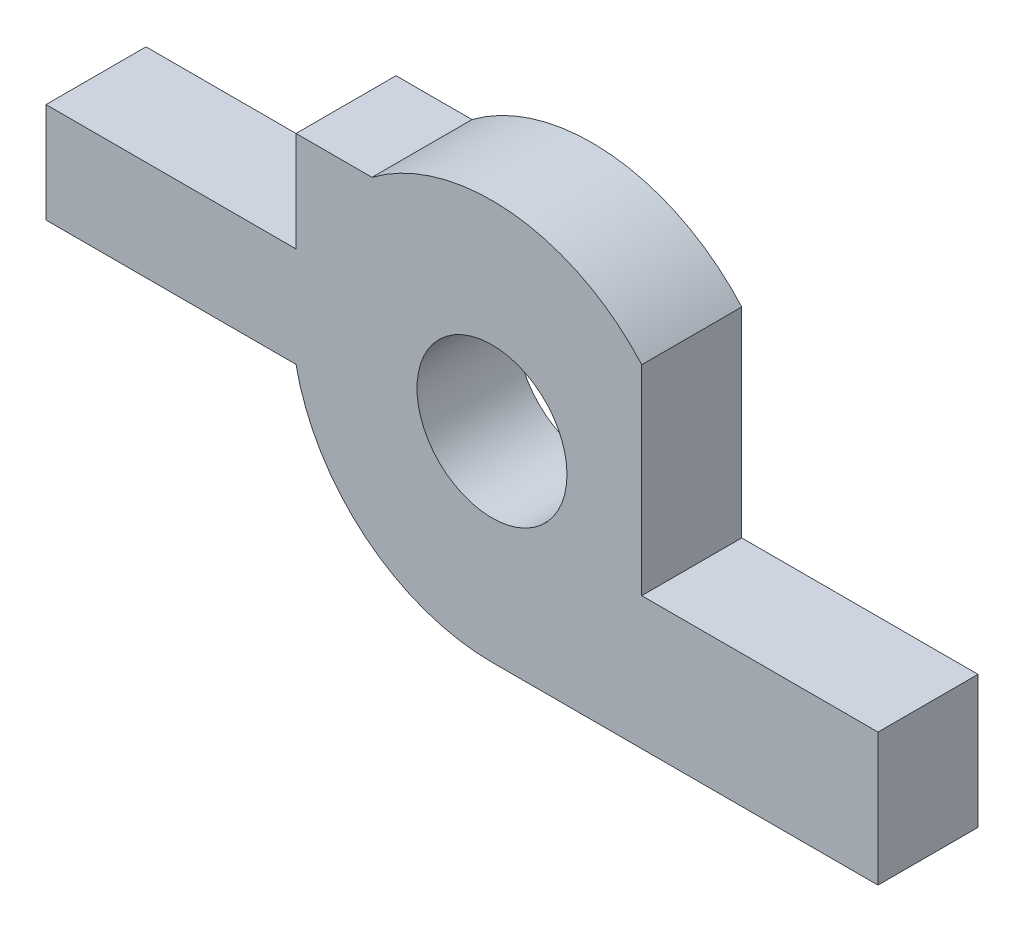
ISO-10303-21;
HEADER;
FILE_DESCRIPTION(('STEP AP214'),'2;1');
FILE_NAME('part.step','',(''),(''),'','','');
FILE_SCHEMA(('AUTOMOTIVE_DESIGN { 1 0 10303 214 1 1 1 1 }'));
ENDSEC;
DATA;
#1=APPLICATION_CONTEXT('core data for automotive mechanical design processes');
#2=APPLICATION_PROTOCOL_DEFINITION('international standard','automotive_design',2000,#1);
#3=PRODUCT_CONTEXT('',#1,'mechanical');
#4=PRODUCT('Part','Part','',(#3));
#5=PRODUCT_RELATED_PRODUCT_CATEGORY('part','',(#4));
#6=PRODUCT_DEFINITION_FORMATION('','',#4);
#7=PRODUCT_DEFINITION_CONTEXT('part definition',#1,'design');
#8=PRODUCT_DEFINITION('design','',#6,#7);
#9=PRODUCT_DEFINITION_SHAPE('','',#8);
#10=(LENGTH_UNIT() NAMED_UNIT(*) SI_UNIT(.MILLI.,.METRE.));
#11=(NAMED_UNIT(*) PLANE_ANGLE_UNIT() SI_UNIT($,.RADIAN.));
#12=(NAMED_UNIT(*) SI_UNIT($,.STERADIAN.) SOLID_ANGLE_UNIT());
#13=UNCERTAINTY_MEASURE_WITH_UNIT(LENGTH_MEASURE(1.E-05),#10,'distance_accuracy_value','');
#14=(GEOMETRIC_REPRESENTATION_CONTEXT(3) GLOBAL_UNCERTAINTY_ASSIGNED_CONTEXT((#13)) GLOBAL_UNIT_ASSIGNED_CONTEXT((#10,
#11,#12)) REPRESENTATION_CONTEXT('',''));
#15=CARTESIAN_POINT('',(0.,0.,0.));
#16=DIRECTION('',(0.,0.,1.));
#17=DIRECTION('',(1.,0.,0.));
#18=AXIS2_PLACEMENT_3D('',#15,#16,#17);
#19=CARTESIAN_POINT('',(0.,0.,2.));
#20=DIRECTION('',(0.,0.,1.));
#21=DIRECTION('',(1.,0.,0.));
#22=AXIS2_PLACEMENT_3D('',#19,#20,#21);
#23=PLANE('',#22);
#24=CARTESIAN_POINT('',(0.,0.,2.));
#25=DIRECTION('',(0.,0.,1.));
#26=DIRECTION('',(1.,0.,0.));
#27=AXIS2_PLACEMENT_3D('',#24,#25,#26);
#28=CIRCLE('',#27,4.);
#29=CARTESIAN_POINT('',(-3.91918358845309,-0.8,2.));
#30=VERTEX_POINT('',#29);
#31=CARTESIAN_POINT('',(0.,-4.,2.));
#32=VERTEX_POINT('',#31);
#33=EDGE_CURVE('E168',#30,#32,#28,.T.);
#34=ORIENTED_EDGE('',*,*,#33,.T.);
#35=DIRECTION('',(1.,0.,0.));
#36=VECTOR('',#35,1.);
#37=CARTESIAN_POINT('',(7.72000000000002,-4.,2.));
#38=LINE('',#37,#36);
#39=CARTESIAN_POINT('',(7.72000000000002,-4.,2.));
#40=VERTEX_POINT('',#39);
#41=EDGE_CURVE('E101',#32,#40,#38,.T.);
#42=ORIENTED_EDGE('',*,*,#41,.T.);
#43=DIRECTION('',(0.,1.,0.));
#44=VECTOR('',#43,1.);
#45=CARTESIAN_POINT('',(7.72,-1.34852681521862,2.));
#46=LINE('',#45,#44);
#47=CARTESIAN_POINT('',(7.72,-1.34852681521862,2.));
#48=VERTEX_POINT('',#47);
#49=EDGE_CURVE('E192',#40,#48,#46,.T.);
#50=ORIENTED_EDGE('',*,*,#49,.T.);
#51=DIRECTION('',(-1.,0.,0.));
#52=VECTOR('',#51,1.);
#53=CARTESIAN_POINT('',(2.99494406465051,-1.34852681521862,2.));
#54=LINE('',#53,#52);
#55=CARTESIAN_POINT('',(2.99494406465051,-1.34852681521862,2.));
#56=VERTEX_POINT('',#55);
#57=EDGE_CURVE('E211',#48,#56,#54,.T.);
#58=ORIENTED_EDGE('',*,*,#57,.T.);
#59=DIRECTION('',(0.,1.,0.));
#60=VECTOR('',#59,1.);
#61=CARTESIAN_POINT('',(2.99494406465051,2.65147318478138,2.));
#62=LINE('',#61,#60);
#63=CARTESIAN_POINT('',(2.99494406465051,2.65147318478138,2.));
#64=VERTEX_POINT('',#63);
#65=EDGE_CURVE('E208',#56,#64,#62,.T.);
#66=ORIENTED_EDGE('',*,*,#65,.T.);
#67=CARTESIAN_POINT('',(0.,0.,2.));
#68=DIRECTION('',(0.,0.,1.));
#69=DIRECTION('',(1.,0.,0.));
#70=AXIS2_PLACEMENT_3D('',#67,#68,#69);
#71=CIRCLE('',#70,4.);
#72=CARTESIAN_POINT('',(-2.40000000000001,3.2,2.));
#73=VERTEX_POINT('',#72);
#74=EDGE_CURVE('E210',#64,#73,#71,.T.);
#75=ORIENTED_EDGE('',*,*,#74,.T.);
#76=DIRECTION('',(-1.,0.,0.));
#77=VECTOR('',#76,1.);
#78=CARTESIAN_POINT('',(-3.91918358845309,3.2,2.));
#79=LINE('',#78,#77);
#80=CARTESIAN_POINT('',(-3.91918358845309,3.2,2.));
#81=VERTEX_POINT('',#80);
#82=EDGE_CURVE('E213',#73,#81,#79,.T.);
#83=ORIENTED_EDGE('',*,*,#82,.T.);
#84=DIRECTION('',(0.,-1.,0.));
#85=VECTOR('',#84,1.);
#86=CARTESIAN_POINT('',(-3.91918358845309,1.2,2.));
#87=LINE('',#86,#85);
#88=CARTESIAN_POINT('',(-3.91918358845309,1.2,2.));
#89=VERTEX_POINT('',#88);
#90=EDGE_CURVE('E129',#81,#89,#87,.T.);
#91=ORIENTED_EDGE('',*,*,#90,.T.);
#92=DIRECTION('',(-1.,0.,0.));
#93=VECTOR('',#92,1.);
#94=CARTESIAN_POINT('',(-3.91918358845309,1.2,2.));
#95=LINE('',#94,#93);
#96=CARTESIAN_POINT('',(-8.91918358845309,1.2,2.));
#97=VERTEX_POINT('',#96);
#98=EDGE_CURVE('E123',#89,#97,#95,.T.);
#99=ORIENTED_EDGE('',*,*,#98,.T.);
#100=DIRECTION('',(0.,-1.,0.));
#101=VECTOR('',#100,1.);
#102=CARTESIAN_POINT('',(-8.91918358845309,1.2,2.));
#103=LINE('',#102,#101);
#104=CARTESIAN_POINT('',(-8.91918358845305,-0.799999999999993,2.));
#105=VERTEX_POINT('',#104);
#106=EDGE_CURVE('E127',#97,#105,#103,.T.);
#107=ORIENTED_EDGE('',*,*,#106,.T.);
#108=DIRECTION('',(1.,0.,0.));
#109=VECTOR('',#108,1.);
#110=CARTESIAN_POINT('',(-3.91918358845309,-0.8,2.));
#111=LINE('',#110,#109);
#112=EDGE_CURVE('E49',#105,#30,#111,.T.);
#113=ORIENTED_EDGE('',*,*,#112,.T.);
#114=EDGE_LOOP('',(#34,#42,#50,#58,#66,#75,#83,#91,#99,#107,#113));
#115=FACE_BOUND('',#114,.T.);
#116=CARTESIAN_POINT('',(0.,0.,2.));
#117=DIRECTION('',(0.,0.,1.));
#118=DIRECTION('',(1.,0.,0.));
#119=AXIS2_PLACEMENT_3D('',#116,#117,#118);
#120=CIRCLE('',#119,1.5);
#121=CARTESIAN_POINT('',(1.5,0.,2.));
#122=VERTEX_POINT('',#121);
#123=EDGE_CURVE('E151',#122,#122,#120,.T.);
#124=ORIENTED_EDGE('',*,*,#123,.F.);
#125=EDGE_LOOP('',(#124));
#126=FACE_BOUND('',#125,.T.);
#127=ADVANCED_FACE('F32',(#115,#126),#23,.T.);
#128=CARTESIAN_POINT('',(0.,0.,0.));
#129=DIRECTION('',(0.,0.,1.));
#130=DIRECTION('',(1.,0.,0.));
#131=AXIS2_PLACEMENT_3D('',#128,#129,#130);
#132=PLANE('',#131);
#133=CARTESIAN_POINT('',(0.,0.,0.));
#134=DIRECTION('',(0.,0.,1.));
#135=DIRECTION('',(1.,0.,0.));
#136=AXIS2_PLACEMENT_3D('',#133,#134,#135);
#137=CIRCLE('',#136,4.);
#138=CARTESIAN_POINT('',(-3.91918358845309,-0.8,0.));
#139=VERTEX_POINT('',#138);
#140=CARTESIAN_POINT('',(0.,-4.,0.));
#141=VERTEX_POINT('',#140);
#142=EDGE_CURVE('E147',#139,#141,#137,.T.);
#143=ORIENTED_EDGE('',*,*,#142,.F.);
#144=DIRECTION('',(1.,0.,0.));
#145=VECTOR('',#144,1.);
#146=CARTESIAN_POINT('',(-3.91918358845309,-0.8,0.));
#147=LINE('',#146,#145);
#148=CARTESIAN_POINT('',(-8.91918358845305,-0.799999999999993,0.));
#149=VERTEX_POINT('',#148);
#150=EDGE_CURVE('E93',#149,#139,#147,.T.);
#151=ORIENTED_EDGE('',*,*,#150,.F.);
#152=DIRECTION('',(0.,-1.,0.));
#153=VECTOR('',#152,1.);
#154=CARTESIAN_POINT('',(-8.91918358845309,1.2,0.));
#155=LINE('',#154,#153);
#156=CARTESIAN_POINT('',(-8.91918358845309,1.2,0.));
#157=VERTEX_POINT('',#156);
#158=EDGE_CURVE('E87',#157,#149,#155,.T.);
#159=ORIENTED_EDGE('',*,*,#158,.F.);
#160=DIRECTION('',(-1.,0.,0.));
#161=VECTOR('',#160,1.);
#162=CARTESIAN_POINT('',(-3.91918358845309,1.2,0.));
#163=LINE('',#162,#161);
#164=CARTESIAN_POINT('',(-3.91918358845309,1.2,0.));
#165=VERTEX_POINT('',#164);
#166=EDGE_CURVE('E137',#165,#157,#163,.T.);
#167=ORIENTED_EDGE('',*,*,#166,.F.);
#168=DIRECTION('',(0.,-1.,0.));
#169=VECTOR('',#168,1.);
#170=CARTESIAN_POINT('',(-3.91918358845309,1.2,0.));
#171=LINE('',#170,#169);
#172=CARTESIAN_POINT('',(-3.91918358845309,3.2,0.));
#173=VERTEX_POINT('',#172);
#174=EDGE_CURVE('E163',#173,#165,#171,.T.);
#175=ORIENTED_EDGE('',*,*,#174,.F.);
#176=DIRECTION('',(-1.,0.,0.));
#177=VECTOR('',#176,1.);
#178=CARTESIAN_POINT('',(-3.91918358845309,3.2,0.));
#179=LINE('',#178,#177);
#180=CARTESIAN_POINT('',(-2.40000000000001,3.2,0.));
#181=VERTEX_POINT('',#180);
#182=EDGE_CURVE('E161',#181,#173,#179,.T.);
#183=ORIENTED_EDGE('',*,*,#182,.F.);
#184=CARTESIAN_POINT('',(0.,0.,0.));
#185=DIRECTION('',(0.,0.,1.));
#186=DIRECTION('',(1.,0.,0.));
#187=AXIS2_PLACEMENT_3D('',#184,#185,#186);
#188=CIRCLE('',#187,4.);
#189=CARTESIAN_POINT('',(2.99494406465051,2.65147318478138,0.));
#190=VERTEX_POINT('',#189);
#191=EDGE_CURVE('E159',#190,#181,#188,.T.);
#192=ORIENTED_EDGE('',*,*,#191,.F.);
#193=DIRECTION('',(0.,1.,0.));
#194=VECTOR('',#193,1.);
#195=CARTESIAN_POINT('',(2.99494406465051,2.65147318478138,0.));
#196=LINE('',#195,#194);
#197=CARTESIAN_POINT('',(2.99494406465051,-1.34852681521862,0.));
#198=VERTEX_POINT('',#197);
#199=EDGE_CURVE('E157',#198,#190,#196,.T.);
#200=ORIENTED_EDGE('',*,*,#199,.F.);
#201=DIRECTION('',(-1.,0.,0.));
#202=VECTOR('',#201,1.);
#203=CARTESIAN_POINT('',(2.99494406465051,-1.34852681521862,0.));
#204=LINE('',#203,#202);
#205=CARTESIAN_POINT('',(7.72,-1.34852681521862,0.));
#206=VERTEX_POINT('',#205);
#207=EDGE_CURVE('E155',#206,#198,#204,.T.);
#208=ORIENTED_EDGE('',*,*,#207,.F.);
#209=DIRECTION('',(0.,1.,0.));
#210=VECTOR('',#209,1.);
#211=CARTESIAN_POINT('',(7.72,-1.34852681521862,0.));
#212=LINE('',#211,#210);
#213=CARTESIAN_POINT('',(7.72000000000002,-4.,0.));
#214=VERTEX_POINT('',#213);
#215=EDGE_CURVE('E153',#214,#206,#212,.T.);
#216=ORIENTED_EDGE('',*,*,#215,.F.);
#217=DIRECTION('',(1.,0.,0.));
#218=VECTOR('',#217,1.);
#219=CARTESIAN_POINT('',(7.72000000000002,-4.,0.));
#220=LINE('',#219,#218);
#221=EDGE_CURVE('E150',#141,#214,#220,.T.);
#222=ORIENTED_EDGE('',*,*,#221,.F.);
#223=EDGE_LOOP('',(#143,#151,#159,#167,#175,#183,#192,#200,#208,#216,#222));
#224=FACE_BOUND('',#223,.T.);
#225=CARTESIAN_POINT('',(0.,0.,0.));
#226=DIRECTION('',(0.,0.,1.));
#227=DIRECTION('',(1.,0.,0.));
#228=AXIS2_PLACEMENT_3D('',#225,#226,#227);
#229=CIRCLE('',#228,1.5);
#230=CARTESIAN_POINT('',(1.5,0.,0.));
#231=VERTEX_POINT('',#230);
#232=EDGE_CURVE('E351',#231,#231,#229,.T.);
#233=ORIENTED_EDGE('',*,*,#232,.T.);
#234=EDGE_LOOP('',(#233));
#235=FACE_BOUND('',#234,.T.);
#236=ADVANCED_FACE('F196',(#224,#235),#132,.F.);
#237=CARTESIAN_POINT('',(0.,0.,2.));
#238=DIRECTION('',(0.,0.,-1.));
#239=DIRECTION('',(-1.,0.,0.));
#240=AXIS2_PLACEMENT_3D('',#237,#238,#239);
#241=CYLINDRICAL_SURFACE('',#240,4.);
#242=ORIENTED_EDGE('',*,*,#142,.T.);
#243=DIRECTION('',(0.,0.,-1.));
#244=VECTOR('',#243,1.);
#245=CARTESIAN_POINT('',(0.,-4.,2.));
#246=LINE('',#245,#244);
#247=EDGE_CURVE('E11',#32,#141,#246,.T.);
#248=ORIENTED_EDGE('',*,*,#247,.F.);
#249=ORIENTED_EDGE('',*,*,#33,.F.);
#250=DIRECTION('',(0.,0.,-1.));
#251=VECTOR('',#250,1.);
#252=CARTESIAN_POINT('',(-3.91918358845309,-0.8,2.));
#253=LINE('',#252,#251);
#254=EDGE_CURVE('E143',#30,#139,#253,.T.);
#255=ORIENTED_EDGE('',*,*,#254,.T.);
#256=EDGE_LOOP('',(#242,#248,#249,#255));
#257=FACE_BOUND('',#256,.T.);
#258=ADVANCED_FACE('F34',(#257),#241,.T.);
#259=CARTESIAN_POINT('',(7.72000000000002,-4.,2.));
#260=DIRECTION('',(0.,1.,0.));
#261=DIRECTION('',(0.,0.,1.));
#262=AXIS2_PLACEMENT_3D('',#259,#260,#261);
#263=PLANE('',#262);
#264=ORIENTED_EDGE('',*,*,#221,.T.);
#265=DIRECTION('',(0.,0.,-1.));
#266=VECTOR('',#265,1.);
#267=CARTESIAN_POINT('',(7.72000000000002,-4.,2.));
#268=LINE('',#267,#266);
#269=EDGE_CURVE('E41',#40,#214,#268,.T.);
#270=ORIENTED_EDGE('',*,*,#269,.F.);
#271=ORIENTED_EDGE('',*,*,#41,.F.);
#272=ORIENTED_EDGE('',*,*,#247,.T.);
#273=EDGE_LOOP('',(#264,#270,#271,#272));
#274=FACE_BOUND('',#273,.T.);
#275=ADVANCED_FACE('F250',(#274),#263,.F.);
#276=CARTESIAN_POINT('',(7.72,-1.34852681521862,2.));
#277=DIRECTION('',(-1.,0.,0.));
#278=DIRECTION('',(0.,-1.,0.));
#279=AXIS2_PLACEMENT_3D('',#276,#277,#278);
#280=PLANE('',#279);
#281=ORIENTED_EDGE('',*,*,#215,.T.);
#282=DIRECTION('',(0.,0.,-1.));
#283=VECTOR('',#282,1.);
#284=CARTESIAN_POINT('',(7.72,-1.34852681521862,2.));
#285=LINE('',#284,#283);
#286=EDGE_CURVE('E184',#48,#206,#285,.T.);
#287=ORIENTED_EDGE('',*,*,#286,.F.);
#288=ORIENTED_EDGE('',*,*,#49,.F.);
#289=ORIENTED_EDGE('',*,*,#269,.T.);
#290=EDGE_LOOP('',(#281,#287,#288,#289));
#291=FACE_BOUND('',#290,.T.);
#292=ADVANCED_FACE('F190',(#291),#280,.F.);
#293=CARTESIAN_POINT('',(2.99494406465051,-1.34852681521862,2.));
#294=DIRECTION('',(0.,-1.,0.));
#295=DIRECTION('',(1.,0.,0.));
#296=AXIS2_PLACEMENT_3D('',#293,#294,#295);
#297=PLANE('',#296);
#298=ORIENTED_EDGE('',*,*,#207,.T.);
#299=DIRECTION('',(0.,0.,-1.));
#300=VECTOR('',#299,1.);
#301=CARTESIAN_POINT('',(2.99494406465051,-1.34852681521862,2.));
#302=LINE('',#301,#300);
#303=EDGE_CURVE('E181',#56,#198,#302,.T.);
#304=ORIENTED_EDGE('',*,*,#303,.F.);
#305=ORIENTED_EDGE('',*,*,#57,.F.);
#306=ORIENTED_EDGE('',*,*,#286,.T.);
#307=EDGE_LOOP('',(#298,#304,#305,#306));
#308=FACE_BOUND('',#307,.T.);
#309=ADVANCED_FACE('F202',(#308),#297,.F.);
#310=CARTESIAN_POINT('',(2.99494406465051,2.65147318478138,2.));
#311=DIRECTION('',(-1.,0.,0.));
#312=DIRECTION('',(0.,-1.,0.));
#313=AXIS2_PLACEMENT_3D('',#310,#311,#312);
#314=PLANE('',#313);
#315=ORIENTED_EDGE('',*,*,#199,.T.);
#316=DIRECTION('',(0.,0.,-1.));
#317=VECTOR('',#316,1.);
#318=CARTESIAN_POINT('',(2.99494406465051,2.65147318478138,2.));
#319=LINE('',#318,#317);
#320=EDGE_CURVE('E178',#64,#190,#319,.T.);
#321=ORIENTED_EDGE('',*,*,#320,.F.);
#322=ORIENTED_EDGE('',*,*,#65,.F.);
#323=ORIENTED_EDGE('',*,*,#303,.T.);
#324=EDGE_LOOP('',(#315,#321,#322,#323));
#325=FACE_BOUND('',#324,.T.);
#326=ADVANCED_FACE('F206',(#325),#314,.F.);
#327=CARTESIAN_POINT('',(0.,0.,2.));
#328=DIRECTION('',(0.,0.,-1.));
#329=DIRECTION('',(-1.,0.,0.));
#330=AXIS2_PLACEMENT_3D('',#327,#328,#329);
#331=CYLINDRICAL_SURFACE('',#330,4.);
#332=ORIENTED_EDGE('',*,*,#191,.T.);
#333=DIRECTION('',(0.,0.,-1.));
#334=VECTOR('',#333,1.);
#335=CARTESIAN_POINT('',(-2.40000000000001,3.2,2.));
#336=LINE('',#335,#334);
#337=EDGE_CURVE('E175',#73,#181,#336,.T.);
#338=ORIENTED_EDGE('',*,*,#337,.F.);
#339=ORIENTED_EDGE('',*,*,#74,.F.);
#340=ORIENTED_EDGE('',*,*,#320,.T.);
#341=EDGE_LOOP('',(#332,#338,#339,#340));
#342=FACE_BOUND('',#341,.T.);
#343=ADVANCED_FACE('F263',(#342),#331,.T.);
#344=CARTESIAN_POINT('',(-3.91918358845309,3.2,2.));
#345=DIRECTION('',(0.,-1.,0.));
#346=DIRECTION('',(0.,0.,-1.));
#347=AXIS2_PLACEMENT_3D('',#344,#345,#346);
#348=PLANE('',#347);
#349=ORIENTED_EDGE('',*,*,#182,.T.);
#350=DIRECTION('',(0.,0.,-1.));
#351=VECTOR('',#350,1.);
#352=CARTESIAN_POINT('',(-3.91918358845309,3.2,2.));
#353=LINE('',#352,#351);
#354=EDGE_CURVE('E172',#81,#173,#353,.T.);
#355=ORIENTED_EDGE('',*,*,#354,.F.);
#356=ORIENTED_EDGE('',*,*,#82,.F.);
#357=ORIENTED_EDGE('',*,*,#337,.T.);
#358=EDGE_LOOP('',(#349,#355,#356,#357));
#359=FACE_BOUND('',#358,.T.);
#360=ADVANCED_FACE('F222',(#359),#348,.F.);
#361=CARTESIAN_POINT('',(-3.91918358845309,1.2,2.));
#362=DIRECTION('',(1.,0.,0.));
#363=DIRECTION('',(0.,0.,-1.));
#364=AXIS2_PLACEMENT_3D('',#361,#362,#363);
#365=PLANE('',#364);
#366=ORIENTED_EDGE('',*,*,#174,.T.);
#367=DIRECTION('',(0.,0.,-1.));
#368=VECTOR('',#367,1.);
#369=CARTESIAN_POINT('',(-3.91918358845309,1.2,2.));
#370=LINE('',#369,#368);
#371=EDGE_CURVE('E138',#89,#165,#370,.T.);
#372=ORIENTED_EDGE('',*,*,#371,.F.);
#373=ORIENTED_EDGE('',*,*,#90,.F.);
#374=ORIENTED_EDGE('',*,*,#354,.T.);
#375=EDGE_LOOP('',(#366,#372,#373,#374));
#376=FACE_BOUND('',#375,.T.);
#377=ADVANCED_FACE('F226',(#376),#365,.F.);
#378=CARTESIAN_POINT('',(-3.91918358845309,1.2,2.));
#379=DIRECTION('',(0.,-1.,0.));
#380=DIRECTION('',(1.,0.,0.));
#381=AXIS2_PLACEMENT_3D('',#378,#379,#380);
#382=PLANE('',#381);
#383=ORIENTED_EDGE('',*,*,#166,.T.);
#384=DIRECTION('',(0.,0.,-1.));
#385=VECTOR('',#384,1.);
#386=CARTESIAN_POINT('',(-8.91918358845309,1.2,2.));
#387=LINE('',#386,#385);
#388=EDGE_CURVE('E134',#97,#157,#387,.T.);
#389=ORIENTED_EDGE('',*,*,#388,.F.);
#390=ORIENTED_EDGE('',*,*,#98,.F.);
#391=ORIENTED_EDGE('',*,*,#371,.T.);
#392=EDGE_LOOP('',(#383,#389,#390,#391));
#393=FACE_BOUND('',#392,.T.);
#394=ADVANCED_FACE('F135',(#393),#382,.F.);
#395=CARTESIAN_POINT('',(-8.91918358845309,1.2,2.));
#396=DIRECTION('',(1.,0.,0.));
#397=DIRECTION('',(0.,1.,0.));
#398=AXIS2_PLACEMENT_3D('',#395,#396,#397);
#399=PLANE('',#398);
#400=ORIENTED_EDGE('',*,*,#158,.T.);
#401=DIRECTION('',(0.,0.,-1.));
#402=VECTOR('',#401,1.);
#403=CARTESIAN_POINT('',(-8.91918358845305,-0.799999999999993,2.));
#404=LINE('',#403,#402);
#405=EDGE_CURVE('E139',#105,#149,#404,.T.);
#406=ORIENTED_EDGE('',*,*,#405,.F.);
#407=ORIENTED_EDGE('',*,*,#106,.F.);
#408=ORIENTED_EDGE('',*,*,#388,.T.);
#409=EDGE_LOOP('',(#400,#406,#407,#408));
#410=FACE_BOUND('',#409,.T.);
#411=ADVANCED_FACE('F141',(#410),#399,.F.);
#412=CARTESIAN_POINT('',(-3.91918358845309,-0.8,2.));
#413=DIRECTION('',(0.,1.,0.));
#414=DIRECTION('',(-1.,0.,0.));
#415=AXIS2_PLACEMENT_3D('',#412,#413,#414);
#416=PLANE('',#415);
#417=ORIENTED_EDGE('',*,*,#150,.T.);
#418=ORIENTED_EDGE('',*,*,#254,.F.);
#419=ORIENTED_EDGE('',*,*,#112,.F.);
#420=ORIENTED_EDGE('',*,*,#405,.T.);
#421=EDGE_LOOP('',(#417,#418,#419,#420));
#422=FACE_BOUND('',#421,.T.);
#423=ADVANCED_FACE('F230',(#422),#416,.F.);
#424=CARTESIAN_POINT('',(0.,0.,2.));
#425=DIRECTION('',(0.,0.,-1.));
#426=DIRECTION('',(-1.,0.,0.));
#427=AXIS2_PLACEMENT_3D('',#424,#425,#426);
#428=CYLINDRICAL_SURFACE('',#427,1.5);
#429=ORIENTED_EDGE('',*,*,#123,.T.);
#430=EDGE_LOOP('',(#429));
#431=FACE_BOUND('',#430,.T.);
#432=ORIENTED_EDGE('',*,*,#232,.F.);
#433=EDGE_LOOP('',(#432));
#434=FACE_BOUND('',#433,.T.);
#435=ADVANCED_FACE('F232',(#431,#434),#428,.F.);
#436=CLOSED_SHELL('',(#127,#236,#258,#275,#292,#309,#326,#343,#360,#377,#394,#411,#423,#435));
#437=MANIFOLD_SOLID_BREP('B2',#436);
#438=ADVANCED_BREP_SHAPE_REPRESENTATION('',(#18,#437),#14);
#439=SHAPE_DEFINITION_REPRESENTATION(#9,#438);
ENDSEC;
END-ISO-10303-21;
